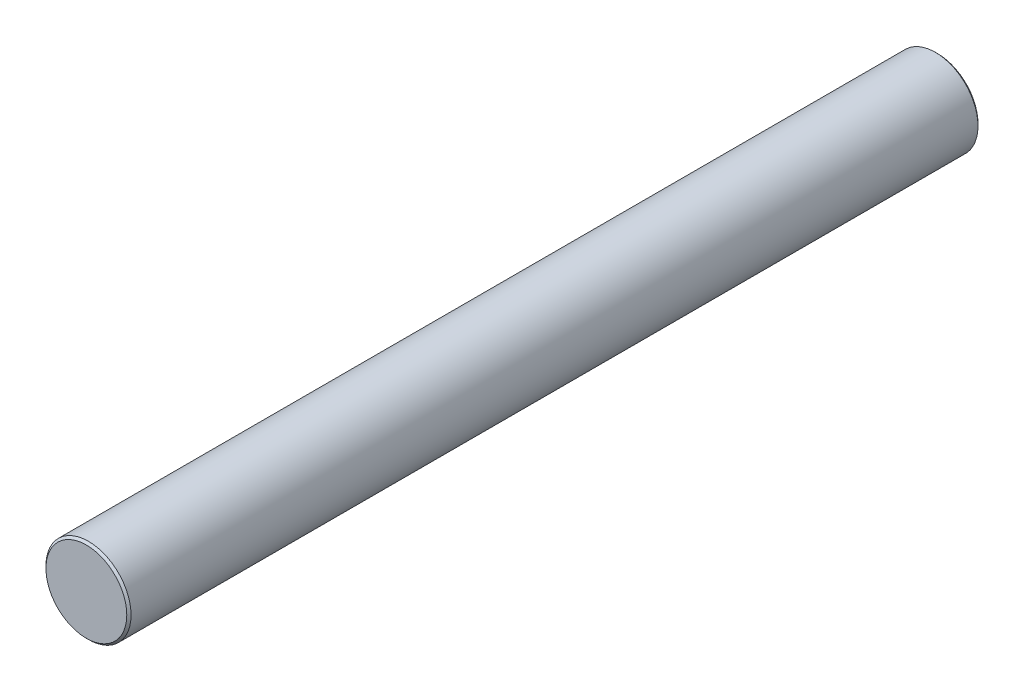
ISO-10303-21;
HEADER;
FILE_DESCRIPTION(('STEP AP214'),'2;1');
FILE_NAME('part.step','',(''),(''),'','','');
FILE_SCHEMA(('AUTOMOTIVE_DESIGN { 1 0 10303 214 1 1 1 1 }'));
ENDSEC;
DATA;
#1=APPLICATION_CONTEXT('core data for automotive mechanical design processes');
#2=APPLICATION_PROTOCOL_DEFINITION('international standard','automotive_design',2000,#1);
#3=PRODUCT_CONTEXT('',#1,'mechanical');
#4=PRODUCT('Part','Part','',(#3));
#5=PRODUCT_RELATED_PRODUCT_CATEGORY('part','',(#4));
#6=PRODUCT_DEFINITION_FORMATION('','',#4);
#7=PRODUCT_DEFINITION_CONTEXT('part definition',#1,'design');
#8=PRODUCT_DEFINITION('design','',#6,#7);
#9=PRODUCT_DEFINITION_SHAPE('','',#8);
#10=(LENGTH_UNIT() NAMED_UNIT(*) SI_UNIT(.MILLI.,.METRE.));
#11=(NAMED_UNIT(*) PLANE_ANGLE_UNIT() SI_UNIT($,.RADIAN.));
#12=(NAMED_UNIT(*) SI_UNIT($,.STERADIAN.) SOLID_ANGLE_UNIT());
#13=UNCERTAINTY_MEASURE_WITH_UNIT(LENGTH_MEASURE(1.E-05),#10,'distance_accuracy_value','');
#14=(GEOMETRIC_REPRESENTATION_CONTEXT(3) GLOBAL_UNCERTAINTY_ASSIGNED_CONTEXT((#13)) GLOBAL_UNIT_ASSIGNED_CONTEXT((#10,
#11,#12)) REPRESENTATION_CONTEXT('',''));
#15=CARTESIAN_POINT('',(0.,0.,0.));
#16=DIRECTION('',(0.,0.,1.));
#17=DIRECTION('',(1.,0.,0.));
#18=AXIS2_PLACEMENT_3D('',#15,#16,#17);
#19=CARTESIAN_POINT('',(0.,0.,50.8));
#20=DIRECTION('',(0.,0.,-1.));
#21=DIRECTION('',(-1.,0.,0.));
#22=AXIS2_PLACEMENT_3D('',#19,#20,#21);
#23=CYLINDRICAL_SURFACE('',#22,5.08);
#24=CARTESIAN_POINT('',(0.,0.,50.546));
#25=DIRECTION('',(0.,0.,1.));
#26=DIRECTION('',(1.,0.,0.));
#27=AXIS2_PLACEMENT_3D('',#24,#25,#26);
#28=CIRCLE('',#27,5.08);
#29=CARTESIAN_POINT('',(5.08,0.,50.546));
#30=VERTEX_POINT('',#29);
#31=EDGE_CURVE('E48',#30,#30,#28,.F.);
#32=ORIENTED_EDGE('',*,*,#31,.T.);
#33=EDGE_LOOP('',(#32));
#34=FACE_BOUND('',#33,.T.);
#35=CARTESIAN_POINT('',(0.,0.,-50.546));
#36=DIRECTION('',(0.,0.,1.));
#37=DIRECTION('',(1.,0.,0.));
#38=AXIS2_PLACEMENT_3D('',#35,#36,#37);
#39=CIRCLE('',#38,5.08);
#40=CARTESIAN_POINT('',(5.08,0.,-50.546));
#41=VERTEX_POINT('',#40);
#42=EDGE_CURVE('E53',#41,#41,#39,.T.);
#43=ORIENTED_EDGE('',*,*,#42,.T.);
#44=EDGE_LOOP('',(#43));
#45=FACE_BOUND('',#44,.T.);
#46=ADVANCED_FACE('F39',(#34,#45),#23,.T.);
#47=CARTESIAN_POINT('',(0.,0.,50.8));
#48=DIRECTION('',(0.,0.,1.));
#49=DIRECTION('',(1.,0.,0.));
#50=AXIS2_PLACEMENT_3D('',#47,#48,#49);
#51=PLANE('',#50);
#52=CARTESIAN_POINT('',(0.,0.,50.8));
#53=DIRECTION('',(0.,0.,1.));
#54=DIRECTION('',(1.,0.,0.));
#55=AXIS2_PLACEMENT_3D('',#52,#53,#54);
#56=CIRCLE('',#55,4.826);
#57=CARTESIAN_POINT('',(4.826,0.,50.8));
#58=VERTEX_POINT('',#57);
#59=EDGE_CURVE('E58',#58,#58,#56,.T.);
#60=ORIENTED_EDGE('',*,*,#59,.T.);
#61=EDGE_LOOP('',(#60));
#62=FACE_BOUND('',#61,.T.);
#63=ADVANCED_FACE('F65',(#62),#51,.T.);
#64=CARTESIAN_POINT('',(0.,0.,-50.8));
#65=DIRECTION('',(0.,0.,1.));
#66=DIRECTION('',(1.,0.,0.));
#67=AXIS2_PLACEMENT_3D('',#64,#65,#66);
#68=PLANE('',#67);
#69=CARTESIAN_POINT('',(0.,0.,-50.8));
#70=DIRECTION('',(0.,0.,1.));
#71=DIRECTION('',(1.,0.,0.));
#72=AXIS2_PLACEMENT_3D('',#69,#70,#71);
#73=CIRCLE('',#72,4.82600000000001);
#74=CARTESIAN_POINT('',(4.82600000000001,0.,-50.8));
#75=VERTEX_POINT('',#74);
#76=EDGE_CURVE('E10',#75,#75,#73,.F.);
#77=ORIENTED_EDGE('',*,*,#76,.T.);
#78=EDGE_LOOP('',(#77));
#79=FACE_BOUND('',#78,.T.);
#80=ADVANCED_FACE('F69',(#79),#68,.F.);
#81=CARTESIAN_POINT('',(0.,0.,50.8));
#82=DIRECTION('',(0.,0.,-1.));
#83=DIRECTION('',(-1.,0.,0.));
#84=AXIS2_PLACEMENT_3D('',#81,#82,#83);
#85=CONICAL_SURFACE('',#84,4.826,0.785398163397435);
#86=ORIENTED_EDGE('',*,*,#31,.F.);
#87=EDGE_LOOP('',(#86));
#88=FACE_BOUND('',#87,.T.);
#89=ORIENTED_EDGE('',*,*,#59,.F.);
#90=EDGE_LOOP('',(#89));
#91=FACE_BOUND('',#90,.T.);
#92=ADVANCED_FACE('F67',(#88,#91),#85,.T.);
#93=CARTESIAN_POINT('',(0.,0.,-50.546));
#94=DIRECTION('',(0.,0.,1.));
#95=DIRECTION('',(1.,0.,0.));
#96=AXIS2_PLACEMENT_3D('',#93,#94,#95);
#97=CONICAL_SURFACE('',#96,5.08,0.785398163397448);
#98=ORIENTED_EDGE('',*,*,#76,.F.);
#99=EDGE_LOOP('',(#98));
#100=FACE_BOUND('',#99,.T.);
#101=ORIENTED_EDGE('',*,*,#42,.F.);
#102=EDGE_LOOP('',(#101));
#103=FACE_BOUND('',#102,.T.);
#104=ADVANCED_FACE('F42',(#100,#103),#97,.T.);
#105=CLOSED_SHELL('',(#46,#63,#80,#92,#104));
#106=MANIFOLD_SOLID_BREP('B2',#105);
#107=ADVANCED_BREP_SHAPE_REPRESENTATION('',(#18,#106),#14);
#108=SHAPE_DEFINITION_REPRESENTATION(#9,#107);
ENDSEC;
END-ISO-10303-21;
